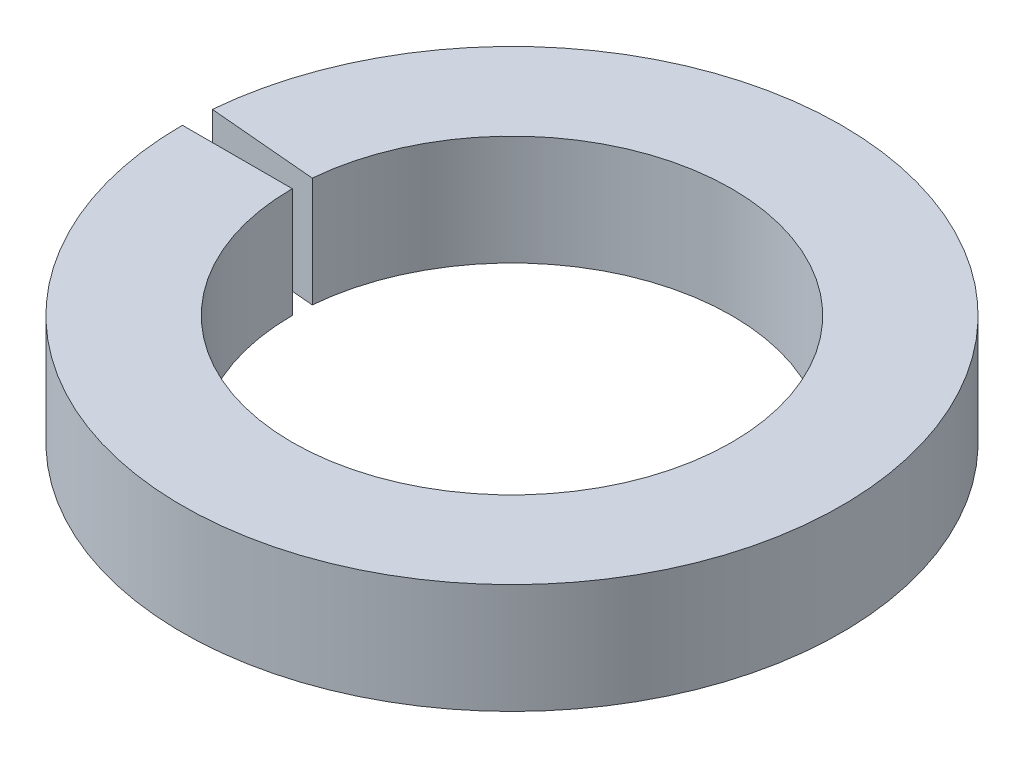
ISO-10303-21;
HEADER;
FILE_DESCRIPTION(('STEP AP214'),'2;1');
FILE_NAME('part.step','',(''),(''),'','','');
FILE_SCHEMA(('AUTOMOTIVE_DESIGN { 1 0 10303 214 1 1 1 1 }'));
ENDSEC;
DATA;
#1=APPLICATION_CONTEXT('core data for automotive mechanical design processes');
#2=APPLICATION_PROTOCOL_DEFINITION('international standard','automotive_design',2000,#1);
#3=PRODUCT_CONTEXT('',#1,'mechanical');
#4=PRODUCT('Part','Part','',(#3));
#5=PRODUCT_RELATED_PRODUCT_CATEGORY('part','',(#4));
#6=PRODUCT_DEFINITION_FORMATION('','',#4);
#7=PRODUCT_DEFINITION_CONTEXT('part definition',#1,'design');
#8=PRODUCT_DEFINITION('design','',#6,#7);
#9=PRODUCT_DEFINITION_SHAPE('','',#8);
#10=(LENGTH_UNIT() NAMED_UNIT(*) SI_UNIT(.MILLI.,.METRE.));
#11=(NAMED_UNIT(*) PLANE_ANGLE_UNIT() SI_UNIT($,.RADIAN.));
#12=(NAMED_UNIT(*) SI_UNIT($,.STERADIAN.) SOLID_ANGLE_UNIT());
#13=UNCERTAINTY_MEASURE_WITH_UNIT(LENGTH_MEASURE(1.E-05),#10,'distance_accuracy_value','');
#14=(GEOMETRIC_REPRESENTATION_CONTEXT(3) GLOBAL_UNCERTAINTY_ASSIGNED_CONTEXT((#13)) GLOBAL_UNIT_ASSIGNED_CONTEXT((#10,
#11,#12)) REPRESENTATION_CONTEXT('',''));
#15=CARTESIAN_POINT('',(0.,0.,0.));
#16=DIRECTION('',(0.,0.,1.));
#17=DIRECTION('',(1.,0.,0.));
#18=AXIS2_PLACEMENT_3D('',#15,#16,#17);
#19=CARTESIAN_POINT('',(0.,0.,0.));
#20=DIRECTION('',(0.,-1.,0.));
#21=DIRECTION('',(0.,0.,-1.));
#22=AXIS2_PLACEMENT_3D('',#19,#20,#21);
#23=CYLINDRICAL_SURFACE('',#22,9.525);
#24=CARTESIAN_POINT('',(0.,3.175,0.));
#25=DIRECTION('',(0.,-1.,0.));
#26=DIRECTION('',(0.,0.,-1.));
#27=AXIS2_PLACEMENT_3D('',#24,#25,#26);
#28=CIRCLE('',#27,9.525);
#29=CARTESIAN_POINT('',(-9.48875449932389,3.175,-0.830158449671319));
#30=VERTEX_POINT('',#29);
#31=CARTESIAN_POINT('',(-9.525,3.175,0.));
#32=VERTEX_POINT('',#31);
#33=EDGE_CURVE('E11',#30,#32,#28,.T.);
#34=ORIENTED_EDGE('',*,*,#33,.T.);
#35=DIRECTION('',(0.,-1.,0.));
#36=VECTOR('',#35,1.);
#37=CARTESIAN_POINT('',(-9.525,0.,0.));
#38=LINE('',#37,#36);
#39=CARTESIAN_POINT('',(-9.525,0.,0.));
#40=VERTEX_POINT('',#39);
#41=EDGE_CURVE('E95',#32,#40,#38,.T.);
#42=ORIENTED_EDGE('',*,*,#41,.T.);
#43=CARTESIAN_POINT('',(0.,0.,0.));
#44=DIRECTION('',(0.,-1.,0.));
#45=DIRECTION('',(0.,0.,-1.));
#46=AXIS2_PLACEMENT_3D('',#43,#44,#45);
#47=CIRCLE('',#46,9.525);
#48=CARTESIAN_POINT('',(-9.48875449932389,0.,-0.830158449671319));
#49=VERTEX_POINT('',#48);
#50=EDGE_CURVE('E77',#49,#40,#47,.T.);
#51=ORIENTED_EDGE('',*,*,#50,.F.);
#52=DIRECTION('',(0.,-1.,0.));
#53=VECTOR('',#52,1.);
#54=CARTESIAN_POINT('',(-9.48875449932389,0.,-0.830158449671319));
#55=LINE('',#54,#53);
#56=EDGE_CURVE('E103',#30,#49,#55,.T.);
#57=ORIENTED_EDGE('',*,*,#56,.F.);
#58=EDGE_LOOP('',(#34,#42,#51,#57));
#59=FACE_BOUND('',#58,.T.);
#60=ADVANCED_FACE('F37',(#59),#23,.T.);
#61=CARTESIAN_POINT('',(-9.48875449932389,3.175,-0.830158449671319));
#62=DIRECTION('',(0.,-1.,0.));
#63=DIRECTION('',(0.,0.,-1.));
#64=AXIS2_PLACEMENT_3D('',#61,#62,#63);
#65=PLANE('',#64);
#66=CARTESIAN_POINT('',(0.,3.175,0.));
#67=DIRECTION('',(0.,-1.,0.));
#68=DIRECTION('',(0.,0.,-1.));
#69=AXIS2_PLACEMENT_3D('',#66,#67,#68);
#70=CIRCLE('',#69,6.35);
#71=CARTESIAN_POINT('',(-6.32583633288259,3.175,-0.553438966447546));
#72=VERTEX_POINT('',#71);
#73=CARTESIAN_POINT('',(-6.35,3.175,0.));
#74=VERTEX_POINT('',#73);
#75=EDGE_CURVE('E45',#72,#74,#70,.T.);
#76=ORIENTED_EDGE('',*,*,#75,.T.);
#77=DIRECTION('',(-1.,0.,0.));
#78=VECTOR('',#77,1.);
#79=CARTESIAN_POINT('',(-9.525,3.175,0.));
#80=LINE('',#79,#78);
#81=EDGE_CURVE('E101',#74,#32,#80,.T.);
#82=ORIENTED_EDGE('',*,*,#81,.T.);
#83=ORIENTED_EDGE('',*,*,#33,.F.);
#84=DIRECTION('',(-0.996194698091747,0.,-0.087155742747645));
#85=VECTOR('',#84,1.);
#86=CARTESIAN_POINT('',(-9.48875449932389,3.175,-0.830158449671319));
#87=LINE('',#86,#85);
#88=EDGE_CURVE('E89',#72,#30,#87,.T.);
#89=ORIENTED_EDGE('',*,*,#88,.F.);
#90=EDGE_LOOP('',(#76,#82,#83,#89));
#91=FACE_BOUND('',#90,.T.);
#92=ADVANCED_FACE('F39',(#91),#65,.F.);
#93=CARTESIAN_POINT('',(0.,0.,0.));
#94=DIRECTION('',(0.,-1.,0.));
#95=DIRECTION('',(0.,0.,-1.));
#96=AXIS2_PLACEMENT_3D('',#93,#94,#95);
#97=CYLINDRICAL_SURFACE('',#96,6.35);
#98=CARTESIAN_POINT('',(0.,0.,0.));
#99=DIRECTION('',(0.,-1.,0.));
#100=DIRECTION('',(0.,0.,-1.));
#101=AXIS2_PLACEMENT_3D('',#98,#99,#100);
#102=CIRCLE('',#101,6.35);
#103=CARTESIAN_POINT('',(-6.32583633288259,0.,-0.553438966447546));
#104=VERTEX_POINT('',#103);
#105=CARTESIAN_POINT('',(-6.35,0.,0.));
#106=VERTEX_POINT('',#105);
#107=EDGE_CURVE('E88',#104,#106,#102,.T.);
#108=ORIENTED_EDGE('',*,*,#107,.T.);
#109=DIRECTION('',(0.,1.,0.));
#110=VECTOR('',#109,1.);
#111=CARTESIAN_POINT('',(-6.35,0.,0.));
#112=LINE('',#111,#110);
#113=EDGE_CURVE('E96',#106,#74,#112,.T.);
#114=ORIENTED_EDGE('',*,*,#113,.T.);
#115=ORIENTED_EDGE('',*,*,#75,.F.);
#116=DIRECTION('',(0.,1.,0.));
#117=VECTOR('',#116,1.);
#118=CARTESIAN_POINT('',(-6.32583633288259,0.,-0.553438966447546));
#119=LINE('',#118,#117);
#120=EDGE_CURVE('E106',#104,#72,#119,.T.);
#121=ORIENTED_EDGE('',*,*,#120,.F.);
#122=EDGE_LOOP('',(#108,#114,#115,#121));
#123=FACE_BOUND('',#122,.T.);
#124=ADVANCED_FACE('F109',(#123),#97,.F.);
#125=CARTESIAN_POINT('',(-9.48875449932389,0.,-0.830158449671319));
#126=DIRECTION('',(0.,1.,0.));
#127=DIRECTION('',(0.,0.,1.));
#128=AXIS2_PLACEMENT_3D('',#125,#126,#127);
#129=PLANE('',#128);
#130=DIRECTION('',(0.996194698091747,0.,0.087155742747645));
#131=VECTOR('',#130,1.);
#132=CARTESIAN_POINT('',(-9.48875449932389,0.,-0.830158449671319));
#133=LINE('',#132,#131);
#134=EDGE_CURVE('E83',#49,#104,#133,.T.);
#135=ORIENTED_EDGE('',*,*,#134,.F.);
#136=ORIENTED_EDGE('',*,*,#50,.T.);
#137=DIRECTION('',(1.,0.,0.));
#138=VECTOR('',#137,1.);
#139=CARTESIAN_POINT('',(-9.525,0.,0.));
#140=LINE('',#139,#138);
#141=EDGE_CURVE('E80',#40,#106,#140,.T.);
#142=ORIENTED_EDGE('',*,*,#141,.T.);
#143=ORIENTED_EDGE('',*,*,#107,.F.);
#144=EDGE_LOOP('',(#135,#136,#142,#143));
#145=FACE_BOUND('',#144,.T.);
#146=ADVANCED_FACE('F79',(#145),#129,.F.);
#147=CARTESIAN_POINT('',(0.,0.,0.));
#148=DIRECTION('',(0.087155742747645,0.,-0.996194698091747));
#149=DIRECTION('',(-0.996194698091747,0.,-0.087155742747645));
#150=AXIS2_PLACEMENT_3D('',#147,#148,#149);
#151=PLANE('',#150);
#152=ORIENTED_EDGE('',*,*,#56,.T.);
#153=ORIENTED_EDGE('',*,*,#134,.T.);
#154=ORIENTED_EDGE('',*,*,#120,.T.);
#155=ORIENTED_EDGE('',*,*,#88,.T.);
#156=EDGE_LOOP('',(#152,#153,#154,#155));
#157=FACE_BOUND('',#156,.T.);
#158=ADVANCED_FACE('F111',(#157),#151,.F.);
#159=CARTESIAN_POINT('',(0.,0.,0.));
#160=DIRECTION('',(0.,0.,-1.));
#161=DIRECTION('',(-1.,0.,0.));
#162=AXIS2_PLACEMENT_3D('',#159,#160,#161);
#163=PLANE('',#162);
#164=ORIENTED_EDGE('',*,*,#41,.F.);
#165=ORIENTED_EDGE('',*,*,#81,.F.);
#166=ORIENTED_EDGE('',*,*,#113,.F.);
#167=ORIENTED_EDGE('',*,*,#141,.F.);
#168=EDGE_LOOP('',(#164,#165,#166,#167));
#169=FACE_BOUND('',#168,.T.);
#170=ADVANCED_FACE('F93',(#169),#163,.T.);
#171=CLOSED_SHELL('',(#60,#92,#124,#146,#158,#170));
#172=MANIFOLD_SOLID_BREP('B2',#171);
#173=ADVANCED_BREP_SHAPE_REPRESENTATION('',(#18,#172),#14);
#174=SHAPE_DEFINITION_REPRESENTATION(#9,#173);
ENDSEC;
END-ISO-10303-21;
